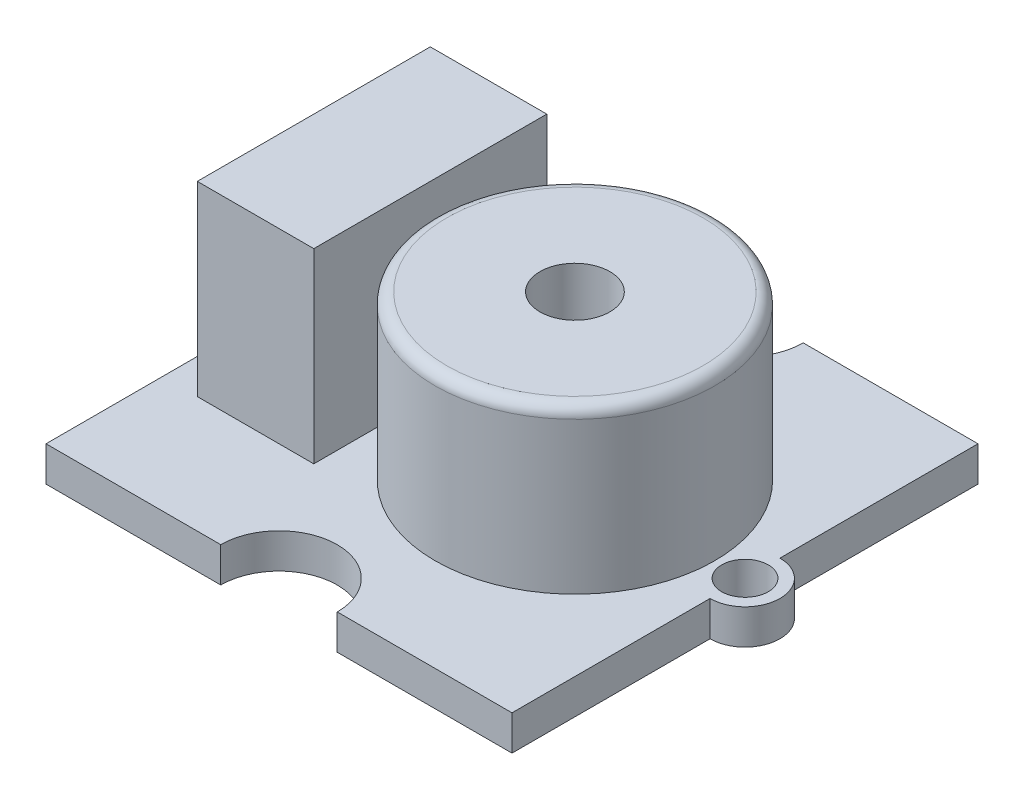
ISO-10303-21;
HEADER;
FILE_DESCRIPTION(('STEP AP214'),'2;1');
FILE_NAME('part.step','',(''),(''),'','','');
FILE_SCHEMA(('AUTOMOTIVE_DESIGN { 1 0 10303 214 1 1 1 1 }'));
ENDSEC;
DATA;
#1=APPLICATION_CONTEXT('core data for automotive mechanical design processes');
#2=APPLICATION_PROTOCOL_DEFINITION('international standard','automotive_design',2000,#1);
#3=PRODUCT_CONTEXT('',#1,'mechanical');
#4=PRODUCT('Part','Part','',(#3));
#5=PRODUCT_RELATED_PRODUCT_CATEGORY('part','',(#4));
#6=PRODUCT_DEFINITION_FORMATION('','',#4);
#7=PRODUCT_DEFINITION_CONTEXT('part definition',#1,'design');
#8=PRODUCT_DEFINITION('design','',#6,#7);
#9=PRODUCT_DEFINITION_SHAPE('','',#8);
#10=(LENGTH_UNIT() NAMED_UNIT(*) SI_UNIT(.MILLI.,.METRE.));
#11=(NAMED_UNIT(*) PLANE_ANGLE_UNIT() SI_UNIT($,.RADIAN.));
#12=(NAMED_UNIT(*) SI_UNIT($,.STERADIAN.) SOLID_ANGLE_UNIT());
#13=UNCERTAINTY_MEASURE_WITH_UNIT(LENGTH_MEASURE(1.E-05),#10,'distance_accuracy_value','');
#14=(GEOMETRIC_REPRESENTATION_CONTEXT(3) GLOBAL_UNCERTAINTY_ASSIGNED_CONTEXT((#13)) GLOBAL_UNIT_ASSIGNED_CONTEXT((#10,
#11,#12)) REPRESENTATION_CONTEXT('',''));
#15=CARTESIAN_POINT('',(0.,0.,0.));
#16=DIRECTION('',(0.,0.,1.));
#17=DIRECTION('',(1.,0.,0.));
#18=AXIS2_PLACEMENT_3D('',#15,#16,#17);
#19=CARTESIAN_POINT('',(0.,1.5,0.));
#20=DIRECTION('',(0.,1.,0.));
#21=DIRECTION('',(0.,0.,1.));
#22=AXIS2_PLACEMENT_3D('',#19,#20,#21);
#23=PLANE('',#22);
#24=CARTESIAN_POINT('',(2.7,1.5,0.));
#25=DIRECTION('',(0.,1.,0.));
#26=DIRECTION('',(0.,0.,1.));
#27=AXIS2_PLACEMENT_3D('',#24,#25,#26);
#28=CIRCLE('',#27,6.);
#29=CARTESIAN_POINT('',(2.7,1.5,6.));
#30=VERTEX_POINT('',#29);
#31=EDGE_CURVE('E559',#30,#30,#28,.T.);
#32=ORIENTED_EDGE('',*,*,#31,.F.);
#33=EDGE_LOOP('',(#32));
#34=FACE_BOUND('',#33,.T.);
#35=CARTESIAN_POINT('',(0.,1.5,10.));
#36=DIRECTION('',(0.,1.,0.));
#37=DIRECTION('',(0.,0.,1.));
#38=AXIS2_PLACEMENT_3D('',#35,#36,#37);
#39=CIRCLE('',#38,2.5);
#40=CARTESIAN_POINT('',(2.50000000000001,1.5,10.));
#41=VERTEX_POINT('',#40);
#42=CARTESIAN_POINT('',(-2.5,1.5,10.));
#43=VERTEX_POINT('',#42);
#44=EDGE_CURVE('E173',#41,#43,#39,.T.);
#45=ORIENTED_EDGE('',*,*,#44,.F.);
#46=DIRECTION('',(1.,0.,0.));
#47=VECTOR('',#46,1.);
#48=CARTESIAN_POINT('',(-9.99999999999999,1.5,10.));
#49=LINE('',#48,#47);
#50=CARTESIAN_POINT('',(10.,1.5,10.));
#51=VERTEX_POINT('',#50);
#52=EDGE_CURVE('E238',#41,#51,#49,.T.);
#53=ORIENTED_EDGE('',*,*,#52,.T.);
#54=DIRECTION('',(0.,0.,-1.));
#55=VECTOR('',#54,1.);
#56=CARTESIAN_POINT('',(10.,1.5,-10.));
#57=LINE('',#56,#55);
#58=CARTESIAN_POINT('',(10.,1.5,1.5));
#59=VERTEX_POINT('',#58);
#60=EDGE_CURVE('E226',#51,#59,#57,.T.);
#61=ORIENTED_EDGE('',*,*,#60,.T.);
#62=CARTESIAN_POINT('',(10.,1.5,0.));
#63=DIRECTION('',(0.,1.,0.));
#64=DIRECTION('',(0.,0.,1.));
#65=AXIS2_PLACEMENT_3D('',#62,#63,#64);
#66=CIRCLE('',#65,1.5);
#67=CARTESIAN_POINT('',(10.,1.5,-1.5));
#68=VERTEX_POINT('',#67);
#69=EDGE_CURVE('E203',#59,#68,#66,.T.);
#70=ORIENTED_EDGE('',*,*,#69,.T.);
#71=CARTESIAN_POINT('',(10.,1.5,-10.));
#72=VERTEX_POINT('',#71);
#73=EDGE_CURVE('E230',#68,#72,#57,.T.);
#74=ORIENTED_EDGE('',*,*,#73,.T.);
#75=DIRECTION('',(-1.,0.,0.));
#76=VECTOR('',#75,1.);
#77=CARTESIAN_POINT('',(-10.,1.5,-10.));
#78=LINE('',#77,#76);
#79=CARTESIAN_POINT('',(2.5,1.5,-10.));
#80=VERTEX_POINT('',#79);
#81=EDGE_CURVE('E231',#72,#80,#78,.T.);
#82=ORIENTED_EDGE('',*,*,#81,.T.);
#83=CARTESIAN_POINT('',(0.,1.5,-10.));
#84=DIRECTION('',(0.,1.,0.));
#85=DIRECTION('',(0.,0.,1.));
#86=AXIS2_PLACEMENT_3D('',#83,#84,#85);
#87=CIRCLE('',#86,2.5);
#88=CARTESIAN_POINT('',(-2.5,1.5,-10.));
#89=VERTEX_POINT('',#88);
#90=EDGE_CURVE('E185',#89,#80,#87,.T.);
#91=ORIENTED_EDGE('',*,*,#90,.F.);
#92=CARTESIAN_POINT('',(-10.,1.5,-10.));
#93=VERTEX_POINT('',#92);
#94=EDGE_CURVE('E229',#89,#93,#78,.T.);
#95=ORIENTED_EDGE('',*,*,#94,.T.);
#96=DIRECTION('',(0.,0.,1.));
#97=VECTOR('',#96,1.);
#98=CARTESIAN_POINT('',(-10.,1.5,-10.));
#99=LINE('',#98,#97);
#100=CARTESIAN_POINT('',(-10.,1.5,-1.5));
#101=VERTEX_POINT('',#100);
#102=EDGE_CURVE('E235',#93,#101,#99,.T.);
#103=ORIENTED_EDGE('',*,*,#102,.T.);
#104=CARTESIAN_POINT('',(-10.,1.5,0.));
#105=DIRECTION('',(0.,1.,0.));
#106=DIRECTION('',(0.,0.,1.));
#107=AXIS2_PLACEMENT_3D('',#104,#105,#106);
#108=CIRCLE('',#107,1.5);
#109=CARTESIAN_POINT('',(-10.,1.5,1.5));
#110=VERTEX_POINT('',#109);
#111=EDGE_CURVE('E215',#101,#110,#108,.T.);
#112=ORIENTED_EDGE('',*,*,#111,.T.);
#113=CARTESIAN_POINT('',(-9.99999999999999,1.5,10.));
#114=VERTEX_POINT('',#113);
#115=EDGE_CURVE('E234',#110,#114,#99,.T.);
#116=ORIENTED_EDGE('',*,*,#115,.T.);
#117=EDGE_CURVE('E239',#114,#43,#49,.T.);
#118=ORIENTED_EDGE('',*,*,#117,.T.);
#119=EDGE_LOOP('',(#45,#53,#61,#70,#74,#82,#91,#95,#103,#112,#116,#118));
#120=FACE_BOUND('',#119,.T.);
#121=CARTESIAN_POINT('',(10.,1.5,0.));
#122=DIRECTION('',(0.,1.,0.));
#123=DIRECTION('',(0.,0.,1.));
#124=AXIS2_PLACEMENT_3D('',#121,#122,#123);
#125=CIRCLE('',#124,1.);
#126=CARTESIAN_POINT('',(10.,1.5,1.));
#127=VERTEX_POINT('',#126);
#128=EDGE_CURVE('E193',#127,#127,#125,.T.);
#129=ORIENTED_EDGE('',*,*,#128,.F.);
#130=EDGE_LOOP('',(#129));
#131=FACE_BOUND('',#130,.T.);
#132=CARTESIAN_POINT('',(-10.,1.5,0.));
#133=DIRECTION('',(0.,1.,0.));
#134=DIRECTION('',(0.,0.,1.));
#135=AXIS2_PLACEMENT_3D('',#132,#133,#134);
#136=CIRCLE('',#135,1.);
#137=CARTESIAN_POINT('',(-10.,1.5,1.));
#138=VERTEX_POINT('',#137);
#139=EDGE_CURVE('E197',#138,#138,#136,.T.);
#140=ORIENTED_EDGE('',*,*,#139,.F.);
#141=EDGE_LOOP('',(#140));
#142=FACE_BOUND('',#141,.T.);
#143=DIRECTION('',(-1.,0.,0.));
#144=VECTOR('',#143,1.);
#145=CARTESIAN_POINT('',(-8.50677552678238,1.5,-5.));
#146=LINE('',#145,#144);
#147=CARTESIAN_POINT('',(-3.50677552678238,1.5,-5.));
#148=VERTEX_POINT('',#147);
#149=CARTESIAN_POINT('',(-8.50677552678238,1.5,-5.));
#150=VERTEX_POINT('',#149);
#151=EDGE_CURVE('E571',#148,#150,#146,.T.);
#152=ORIENTED_EDGE('',*,*,#151,.F.);
#153=DIRECTION('',(0.,0.,-1.));
#154=VECTOR('',#153,1.);
#155=CARTESIAN_POINT('',(-3.50677552678238,1.5,-5.));
#156=LINE('',#155,#154);
#157=CARTESIAN_POINT('',(-3.50677552678237,1.5,5.));
#158=VERTEX_POINT('',#157);
#159=EDGE_CURVE('E171',#158,#148,#156,.T.);
#160=ORIENTED_EDGE('',*,*,#159,.F.);
#161=DIRECTION('',(1.,0.,0.));
#162=VECTOR('',#161,1.);
#163=CARTESIAN_POINT('',(-8.50677552678237,1.5,5.));
#164=LINE('',#163,#162);
#165=CARTESIAN_POINT('',(-8.50677552678237,1.5,5.));
#166=VERTEX_POINT('',#165);
#167=EDGE_CURVE('E167',#166,#158,#164,.T.);
#168=ORIENTED_EDGE('',*,*,#167,.F.);
#169=DIRECTION('',(0.,0.,1.));
#170=VECTOR('',#169,1.);
#171=CARTESIAN_POINT('',(-8.50677552678238,1.5,-5.));
#172=LINE('',#171,#170);
#173=EDGE_CURVE('E573',#150,#166,#172,.T.);
#174=ORIENTED_EDGE('',*,*,#173,.F.);
#175=EDGE_LOOP('',(#152,#160,#168,#174));
#176=FACE_BOUND('',#175,.T.);
#177=ADVANCED_FACE('F35',(#34,#120,#131,#142,#176),#23,.T.);
#178=CARTESIAN_POINT('',(-9.99999999999999,1.5,10.));
#179=DIRECTION('',(0.,0.,-1.));
#180=DIRECTION('',(-1.,0.,0.));
#181=AXIS2_PLACEMENT_3D('',#178,#179,#180);
#182=PLANE('',#181);
#183=DIRECTION('',(1.,0.,0.));
#184=VECTOR('',#183,1.);
#185=CARTESIAN_POINT('',(-9.99999999999999,0.,10.));
#186=LINE('',#185,#184);
#187=CARTESIAN_POINT('',(-9.99999999999999,0.,10.));
#188=VERTEX_POINT('',#187);
#189=CARTESIAN_POINT('',(-2.5,0.,10.));
#190=VERTEX_POINT('',#189);
#191=EDGE_CURVE('E255',#188,#190,#186,.T.);
#192=ORIENTED_EDGE('',*,*,#191,.T.);
#193=DIRECTION('',(0.,1.,0.));
#194=VECTOR('',#193,1.);
#195=CARTESIAN_POINT('',(-2.5,0.,10.));
#196=LINE('',#195,#194);
#197=EDGE_CURVE('E58',#190,#43,#196,.T.);
#198=ORIENTED_EDGE('',*,*,#197,.T.);
#199=ORIENTED_EDGE('',*,*,#117,.F.);
#200=DIRECTION('',(0.,-1.,0.));
#201=VECTOR('',#200,1.);
#202=CARTESIAN_POINT('',(-9.99999999999999,1.5,10.));
#203=LINE('',#202,#201);
#204=EDGE_CURVE('E260',#114,#188,#203,.T.);
#205=ORIENTED_EDGE('',*,*,#204,.T.);
#206=EDGE_LOOP('',(#192,#198,#199,#205));
#207=FACE_BOUND('',#206,.T.);
#208=ADVANCED_FACE('F291',(#207),#182,.F.);
#209=CARTESIAN_POINT('',(-10.,1.5,-10.));
#210=DIRECTION('',(0.,0.,1.));
#211=DIRECTION('',(1.,0.,0.));
#212=AXIS2_PLACEMENT_3D('',#209,#210,#211);
#213=PLANE('',#212);
#214=DIRECTION('',(-1.,0.,0.));
#215=VECTOR('',#214,1.);
#216=CARTESIAN_POINT('',(-10.,0.,-10.));
#217=LINE('',#216,#215);
#218=CARTESIAN_POINT('',(10.,0.,-10.));
#219=VERTEX_POINT('',#218);
#220=CARTESIAN_POINT('',(2.5,0.,-10.));
#221=VERTEX_POINT('',#220);
#222=EDGE_CURVE('E247',#219,#221,#217,.T.);
#223=ORIENTED_EDGE('',*,*,#222,.T.);
#224=DIRECTION('',(0.,1.,0.));
#225=VECTOR('',#224,1.);
#226=CARTESIAN_POINT('',(2.5,0.,-10.));
#227=LINE('',#226,#225);
#228=EDGE_CURVE('E190',#221,#80,#227,.T.);
#229=ORIENTED_EDGE('',*,*,#228,.T.);
#230=ORIENTED_EDGE('',*,*,#81,.F.);
#231=DIRECTION('',(0.,-1.,0.));
#232=VECTOR('',#231,1.);
#233=CARTESIAN_POINT('',(10.,1.5,-10.));
#234=LINE('',#233,#232);
#235=EDGE_CURVE('E266',#72,#219,#234,.T.);
#236=ORIENTED_EDGE('',*,*,#235,.T.);
#237=EDGE_LOOP('',(#223,#229,#230,#236));
#238=FACE_BOUND('',#237,.T.);
#239=ADVANCED_FACE('F297',(#238),#213,.F.);
#240=CARTESIAN_POINT('',(10.,1.5,-10.));
#241=DIRECTION('',(-1.,0.,0.));
#242=DIRECTION('',(0.,0.,1.));
#243=AXIS2_PLACEMENT_3D('',#240,#241,#242);
#244=PLANE('',#243);
#245=DIRECTION('',(0.,0.,-1.));
#246=VECTOR('',#245,1.);
#247=CARTESIAN_POINT('',(10.,0.,-10.));
#248=LINE('',#247,#246);
#249=CARTESIAN_POINT('',(10.,0.,10.));
#250=VERTEX_POINT('',#249);
#251=CARTESIAN_POINT('',(10.,0.,1.5));
#252=VERTEX_POINT('',#251);
#253=EDGE_CURVE('E243',#250,#252,#248,.T.);
#254=ORIENTED_EDGE('',*,*,#253,.T.);
#255=DIRECTION('',(0.,1.,0.));
#256=VECTOR('',#255,1.);
#257=CARTESIAN_POINT('',(10.,0.,1.5));
#258=LINE('',#257,#256);
#259=EDGE_CURVE('E212',#252,#59,#258,.T.);
#260=ORIENTED_EDGE('',*,*,#259,.T.);
#261=ORIENTED_EDGE('',*,*,#60,.F.);
#262=DIRECTION('',(0.,-1.,0.));
#263=VECTOR('',#262,1.);
#264=CARTESIAN_POINT('',(10.,1.5,10.));
#265=LINE('',#264,#263);
#266=EDGE_CURVE('E242',#51,#250,#265,.T.);
#267=ORIENTED_EDGE('',*,*,#266,.T.);
#268=EDGE_LOOP('',(#254,#260,#261,#267));
#269=FACE_BOUND('',#268,.T.);
#270=ADVANCED_FACE('F324',(#269),#244,.F.);
#271=CARTESIAN_POINT('',(-10.,1.5,-10.));
#272=DIRECTION('',(1.,0.,0.));
#273=DIRECTION('',(0.,0.,-1.));
#274=AXIS2_PLACEMENT_3D('',#271,#272,#273);
#275=PLANE('',#274);
#276=DIRECTION('',(0.,0.,1.));
#277=VECTOR('',#276,1.);
#278=CARTESIAN_POINT('',(-10.,0.,-10.));
#279=LINE('',#278,#277);
#280=CARTESIAN_POINT('',(-10.,0.,-10.));
#281=VERTEX_POINT('',#280);
#282=CARTESIAN_POINT('',(-10.,0.,-1.5));
#283=VERTEX_POINT('',#282);
#284=EDGE_CURVE('E251',#281,#283,#279,.T.);
#285=ORIENTED_EDGE('',*,*,#284,.T.);
#286=DIRECTION('',(0.,1.,0.));
#287=VECTOR('',#286,1.);
#288=CARTESIAN_POINT('',(-10.,0.,-1.5));
#289=LINE('',#288,#287);
#290=EDGE_CURVE('E222',#283,#101,#289,.T.);
#291=ORIENTED_EDGE('',*,*,#290,.T.);
#292=ORIENTED_EDGE('',*,*,#102,.F.);
#293=DIRECTION('',(0.,-1.,0.));
#294=VECTOR('',#293,1.);
#295=CARTESIAN_POINT('',(-10.,1.5,-10.));
#296=LINE('',#295,#294);
#297=EDGE_CURVE('E263',#93,#281,#296,.T.);
#298=ORIENTED_EDGE('',*,*,#297,.T.);
#299=EDGE_LOOP('',(#285,#291,#292,#298));
#300=FACE_BOUND('',#299,.T.);
#301=ADVANCED_FACE('F318',(#300),#275,.F.);
#302=ORIENTED_EDGE('',*,*,#73,.F.);
#303=DIRECTION('',(0.,1.,0.));
#304=VECTOR('',#303,1.);
#305=CARTESIAN_POINT('',(10.,0.,-1.5));
#306=LINE('',#305,#304);
#307=CARTESIAN_POINT('',(10.,0.,-1.5));
#308=VERTEX_POINT('',#307);
#309=EDGE_CURVE('E208',#68,#308,#306,.F.);
#310=ORIENTED_EDGE('',*,*,#309,.T.);
#311=EDGE_CURVE('E225',#308,#219,#248,.T.);
#312=ORIENTED_EDGE('',*,*,#311,.T.);
#313=ORIENTED_EDGE('',*,*,#235,.F.);
#314=EDGE_LOOP('',(#302,#310,#312,#313));
#315=FACE_BOUND('',#314,.T.);
#316=ADVANCED_FACE('F320',(#315),#244,.F.);
#317=ORIENTED_EDGE('',*,*,#94,.F.);
#318=DIRECTION('',(0.,1.,0.));
#319=VECTOR('',#318,1.);
#320=CARTESIAN_POINT('',(-2.5,0.,-10.));
#321=LINE('',#320,#319);
#322=CARTESIAN_POINT('',(-2.5,0.,-10.));
#323=VERTEX_POINT('',#322);
#324=EDGE_CURVE('E187',#89,#323,#321,.F.);
#325=ORIENTED_EDGE('',*,*,#324,.T.);
#326=EDGE_CURVE('E246',#323,#281,#217,.T.);
#327=ORIENTED_EDGE('',*,*,#326,.T.);
#328=ORIENTED_EDGE('',*,*,#297,.F.);
#329=EDGE_LOOP('',(#317,#325,#327,#328));
#330=FACE_BOUND('',#329,.T.);
#331=ADVANCED_FACE('F316',(#330),#213,.F.);
#332=ORIENTED_EDGE('',*,*,#115,.F.);
#333=DIRECTION('',(0.,1.,0.));
#334=VECTOR('',#333,1.);
#335=CARTESIAN_POINT('',(-10.,0.,1.5));
#336=LINE('',#335,#334);
#337=CARTESIAN_POINT('',(-10.,0.,1.5));
#338=VERTEX_POINT('',#337);
#339=EDGE_CURVE('E218',#110,#338,#336,.F.);
#340=ORIENTED_EDGE('',*,*,#339,.T.);
#341=EDGE_CURVE('E250',#338,#188,#279,.T.);
#342=ORIENTED_EDGE('',*,*,#341,.T.);
#343=ORIENTED_EDGE('',*,*,#204,.F.);
#344=EDGE_LOOP('',(#332,#340,#342,#343));
#345=FACE_BOUND('',#344,.T.);
#346=ADVANCED_FACE('F312',(#345),#275,.F.);
#347=ORIENTED_EDGE('',*,*,#52,.F.);
#348=DIRECTION('',(0.,1.,0.));
#349=VECTOR('',#348,1.);
#350=CARTESIAN_POINT('',(2.50000000000001,0.,10.));
#351=LINE('',#350,#349);
#352=CARTESIAN_POINT('',(2.50000000000001,0.,10.));
#353=VERTEX_POINT('',#352);
#354=EDGE_CURVE('E180',#41,#353,#351,.F.);
#355=ORIENTED_EDGE('',*,*,#354,.T.);
#356=EDGE_CURVE('E254',#353,#250,#186,.T.);
#357=ORIENTED_EDGE('',*,*,#356,.T.);
#358=ORIENTED_EDGE('',*,*,#266,.F.);
#359=EDGE_LOOP('',(#347,#355,#357,#358));
#360=FACE_BOUND('',#359,.T.);
#361=ADVANCED_FACE('F300',(#360),#182,.F.);
#362=CARTESIAN_POINT('',(0.,0.,0.));
#363=DIRECTION('',(0.,1.,0.));
#364=DIRECTION('',(0.,0.,1.));
#365=AXIS2_PLACEMENT_3D('',#362,#363,#364);
#366=PLANE('',#365);
#367=CARTESIAN_POINT('',(10.,0.,0.));
#368=DIRECTION('',(0.,1.,0.));
#369=DIRECTION('',(0.,0.,1.));
#370=AXIS2_PLACEMENT_3D('',#367,#368,#369);
#371=CIRCLE('',#370,1.);
#372=CARTESIAN_POINT('',(10.,0.,1.));
#373=VERTEX_POINT('',#372);
#374=EDGE_CURVE('E194',#373,#373,#371,.T.);
#375=ORIENTED_EDGE('',*,*,#374,.T.);
#376=EDGE_LOOP('',(#375));
#377=FACE_BOUND('',#376,.T.);
#378=CARTESIAN_POINT('',(-10.,0.,0.));
#379=DIRECTION('',(0.,1.,0.));
#380=DIRECTION('',(0.,0.,1.));
#381=AXIS2_PLACEMENT_3D('',#378,#379,#380);
#382=CIRCLE('',#381,1.);
#383=CARTESIAN_POINT('',(-10.,0.,1.));
#384=VERTEX_POINT('',#383);
#385=EDGE_CURVE('E200',#384,#384,#382,.T.);
#386=ORIENTED_EDGE('',*,*,#385,.T.);
#387=EDGE_LOOP('',(#386));
#388=FACE_BOUND('',#387,.T.);
#389=ORIENTED_EDGE('',*,*,#356,.F.);
#390=CARTESIAN_POINT('',(0.,0.,10.));
#391=DIRECTION('',(0.,1.,0.));
#392=DIRECTION('',(0.,0.,1.));
#393=AXIS2_PLACEMENT_3D('',#390,#391,#392);
#394=CIRCLE('',#393,2.5);
#395=EDGE_CURVE('E175',#353,#190,#394,.T.);
#396=ORIENTED_EDGE('',*,*,#395,.T.);
#397=ORIENTED_EDGE('',*,*,#191,.F.);
#398=ORIENTED_EDGE('',*,*,#341,.F.);
#399=CARTESIAN_POINT('',(-10.,0.,0.));
#400=DIRECTION('',(0.,1.,0.));
#401=DIRECTION('',(0.,0.,1.));
#402=AXIS2_PLACEMENT_3D('',#399,#400,#401);
#403=CIRCLE('',#402,1.5);
#404=EDGE_CURVE('E216',#283,#338,#403,.T.);
#405=ORIENTED_EDGE('',*,*,#404,.F.);
#406=ORIENTED_EDGE('',*,*,#284,.F.);
#407=ORIENTED_EDGE('',*,*,#326,.F.);
#408=CARTESIAN_POINT('',(0.,0.,-10.));
#409=DIRECTION('',(0.,1.,0.));
#410=DIRECTION('',(0.,0.,1.));
#411=AXIS2_PLACEMENT_3D('',#408,#409,#410);
#412=CIRCLE('',#411,2.5);
#413=EDGE_CURVE('E269',#323,#221,#412,.T.);
#414=ORIENTED_EDGE('',*,*,#413,.T.);
#415=ORIENTED_EDGE('',*,*,#222,.F.);
#416=ORIENTED_EDGE('',*,*,#311,.F.);
#417=CARTESIAN_POINT('',(10.,0.,0.));
#418=DIRECTION('',(0.,1.,0.));
#419=DIRECTION('',(0.,0.,1.));
#420=AXIS2_PLACEMENT_3D('',#417,#418,#419);
#421=CIRCLE('',#420,1.5);
#422=EDGE_CURVE('E206',#252,#308,#421,.T.);
#423=ORIENTED_EDGE('',*,*,#422,.F.);
#424=ORIENTED_EDGE('',*,*,#253,.F.);
#425=EDGE_LOOP('',(#389,#396,#397,#398,#405,#406,#407,#414,#415,#416,#423,#424));
#426=FACE_BOUND('',#425,.T.);
#427=ADVANCED_FACE('F307',(#377,#388,#426),#366,.F.);
#428=CARTESIAN_POINT('',(-10.,0.,0.));
#429=DIRECTION('',(0.,1.,0.));
#430=DIRECTION('',(0.,0.,1.));
#431=AXIS2_PLACEMENT_3D('',#428,#429,#430);
#432=CYLINDRICAL_SURFACE('',#431,1.5);
#433=ORIENTED_EDGE('',*,*,#290,.F.);
#434=ORIENTED_EDGE('',*,*,#404,.T.);
#435=ORIENTED_EDGE('',*,*,#339,.F.);
#436=ORIENTED_EDGE('',*,*,#111,.F.);
#437=EDGE_LOOP('',(#433,#434,#435,#436));
#438=FACE_BOUND('',#437,.T.);
#439=ADVANCED_FACE('F305',(#438),#432,.T.);
#440=CARTESIAN_POINT('',(10.,0.,0.));
#441=DIRECTION('',(0.,1.,0.));
#442=DIRECTION('',(0.,0.,1.));
#443=AXIS2_PLACEMENT_3D('',#440,#441,#442);
#444=CYLINDRICAL_SURFACE('',#443,1.5);
#445=ORIENTED_EDGE('',*,*,#259,.F.);
#446=ORIENTED_EDGE('',*,*,#422,.T.);
#447=ORIENTED_EDGE('',*,*,#309,.F.);
#448=ORIENTED_EDGE('',*,*,#69,.F.);
#449=EDGE_LOOP('',(#445,#446,#447,#448));
#450=FACE_BOUND('',#449,.T.);
#451=ADVANCED_FACE('F346',(#450),#444,.T.);
#452=CARTESIAN_POINT('',(-10.,0.,0.));
#453=DIRECTION('',(0.,1.,0.));
#454=DIRECTION('',(0.,0.,1.));
#455=AXIS2_PLACEMENT_3D('',#452,#453,#454);
#456=CYLINDRICAL_SURFACE('',#455,1.);
#457=ORIENTED_EDGE('',*,*,#385,.F.);
#458=EDGE_LOOP('',(#457));
#459=FACE_BOUND('',#458,.T.);
#460=ORIENTED_EDGE('',*,*,#139,.T.);
#461=EDGE_LOOP('',(#460));
#462=FACE_BOUND('',#461,.T.);
#463=ADVANCED_FACE('F382',(#459,#462),#456,.F.);
#464=CARTESIAN_POINT('',(10.,0.,0.));
#465=DIRECTION('',(0.,1.,0.));
#466=DIRECTION('',(0.,0.,1.));
#467=AXIS2_PLACEMENT_3D('',#464,#465,#466);
#468=CYLINDRICAL_SURFACE('',#467,1.);
#469=ORIENTED_EDGE('',*,*,#374,.F.);
#470=EDGE_LOOP('',(#469));
#471=FACE_BOUND('',#470,.T.);
#472=ORIENTED_EDGE('',*,*,#128,.T.);
#473=EDGE_LOOP('',(#472));
#474=FACE_BOUND('',#473,.T.);
#475=ADVANCED_FACE('F376',(#471,#474),#468,.F.);
#476=CARTESIAN_POINT('',(0.,0.,-10.));
#477=DIRECTION('',(0.,1.,0.));
#478=DIRECTION('',(0.,0.,1.));
#479=AXIS2_PLACEMENT_3D('',#476,#477,#478);
#480=CYLINDRICAL_SURFACE('',#479,2.5);
#481=ORIENTED_EDGE('',*,*,#413,.F.);
#482=ORIENTED_EDGE('',*,*,#324,.F.);
#483=ORIENTED_EDGE('',*,*,#90,.T.);
#484=ORIENTED_EDGE('',*,*,#228,.F.);
#485=EDGE_LOOP('',(#481,#482,#483,#484));
#486=FACE_BOUND('',#485,.T.);
#487=ADVANCED_FACE('F353',(#486),#480,.F.);
#488=CARTESIAN_POINT('',(0.,0.,10.));
#489=DIRECTION('',(0.,1.,0.));
#490=DIRECTION('',(0.,0.,1.));
#491=AXIS2_PLACEMENT_3D('',#488,#489,#490);
#492=CYLINDRICAL_SURFACE('',#491,2.5);
#493=ORIENTED_EDGE('',*,*,#395,.F.);
#494=ORIENTED_EDGE('',*,*,#354,.F.);
#495=ORIENTED_EDGE('',*,*,#44,.T.);
#496=ORIENTED_EDGE('',*,*,#197,.F.);
#497=EDGE_LOOP('',(#493,#494,#495,#496));
#498=FACE_BOUND('',#497,.T.);
#499=ADVANCED_FACE('F368',(#498),#492,.F.);
#500=CARTESIAN_POINT('',(-3.50677552678238,9.5,-5.));
#501=DIRECTION('',(-1.,0.,0.));
#502=DIRECTION('',(0.,0.,1.));
#503=AXIS2_PLACEMENT_3D('',#500,#501,#502);
#504=PLANE('',#503);
#505=ORIENTED_EDGE('',*,*,#159,.T.);
#506=DIRECTION('',(0.,-1.,0.));
#507=VECTOR('',#506,1.);
#508=CARTESIAN_POINT('',(-3.50677552678238,9.5,-5.));
#509=LINE('',#508,#507);
#510=CARTESIAN_POINT('',(-3.50677552678238,9.5,-5.));
#511=VERTEX_POINT('',#510);
#512=EDGE_CURVE('E152',#511,#148,#509,.T.);
#513=ORIENTED_EDGE('',*,*,#512,.F.);
#514=DIRECTION('',(0.,0.,-1.));
#515=VECTOR('',#514,1.);
#516=CARTESIAN_POINT('',(-3.50677552678238,9.5,-5.));
#517=LINE('',#516,#515);
#518=CARTESIAN_POINT('',(-3.50677552678237,9.5,5.));
#519=VERTEX_POINT('',#518);
#520=EDGE_CURVE('E159',#519,#511,#517,.T.);
#521=ORIENTED_EDGE('',*,*,#520,.F.);
#522=DIRECTION('',(0.,-1.,0.));
#523=VECTOR('',#522,1.);
#524=CARTESIAN_POINT('',(-3.50677552678237,9.5,5.));
#525=LINE('',#524,#523);
#526=EDGE_CURVE('E569',#519,#158,#525,.T.);
#527=ORIENTED_EDGE('',*,*,#526,.T.);
#528=EDGE_LOOP('',(#505,#513,#521,#527));
#529=FACE_BOUND('',#528,.T.);
#530=ADVANCED_FACE('F169',(#529),#504,.F.);
#531=CARTESIAN_POINT('',(-8.50677552678238,9.5,-5.));
#532=DIRECTION('',(0.,0.,1.));
#533=DIRECTION('',(1.,0.,0.));
#534=AXIS2_PLACEMENT_3D('',#531,#532,#533);
#535=PLANE('',#534);
#536=ORIENTED_EDGE('',*,*,#151,.T.);
#537=DIRECTION('',(0.,-1.,0.));
#538=VECTOR('',#537,1.);
#539=CARTESIAN_POINT('',(-8.50677552678238,9.5,-5.));
#540=LINE('',#539,#538);
#541=CARTESIAN_POINT('',(-8.50677552678238,9.5,-5.));
#542=VERTEX_POINT('',#541);
#543=EDGE_CURVE('E155',#542,#150,#540,.T.);
#544=ORIENTED_EDGE('',*,*,#543,.F.);
#545=DIRECTION('',(-1.,0.,0.));
#546=VECTOR('',#545,1.);
#547=CARTESIAN_POINT('',(-8.50677552678238,9.5,-5.));
#548=LINE('',#547,#546);
#549=EDGE_CURVE('E148',#511,#542,#548,.T.);
#550=ORIENTED_EDGE('',*,*,#549,.F.);
#551=ORIENTED_EDGE('',*,*,#512,.T.);
#552=EDGE_LOOP('',(#536,#544,#550,#551));
#553=FACE_BOUND('',#552,.T.);
#554=ADVANCED_FACE('F150',(#553),#535,.F.);
#555=CARTESIAN_POINT('',(-8.50677552678238,9.5,-5.));
#556=DIRECTION('',(1.,0.,0.));
#557=DIRECTION('',(0.,0.,-1.));
#558=AXIS2_PLACEMENT_3D('',#555,#556,#557);
#559=PLANE('',#558);
#560=ORIENTED_EDGE('',*,*,#173,.T.);
#561=DIRECTION('',(0.,-1.,0.));
#562=VECTOR('',#561,1.);
#563=CARTESIAN_POINT('',(-8.50677552678237,9.5,5.));
#564=LINE('',#563,#562);
#565=CARTESIAN_POINT('',(-8.50677552678237,9.5,5.));
#566=VERTEX_POINT('',#565);
#567=EDGE_CURVE('E50',#566,#166,#564,.T.);
#568=ORIENTED_EDGE('',*,*,#567,.F.);
#569=DIRECTION('',(0.,0.,1.));
#570=VECTOR('',#569,1.);
#571=CARTESIAN_POINT('',(-8.50677552678238,9.5,-5.));
#572=LINE('',#571,#570);
#573=EDGE_CURVE('E158',#542,#566,#572,.T.);
#574=ORIENTED_EDGE('',*,*,#573,.F.);
#575=ORIENTED_EDGE('',*,*,#543,.T.);
#576=EDGE_LOOP('',(#560,#568,#574,#575));
#577=FACE_BOUND('',#576,.T.);
#578=ADVANCED_FACE('F498',(#577),#559,.F.);
#579=CARTESIAN_POINT('',(-8.50677552678237,9.5,5.));
#580=DIRECTION('',(0.,0.,-1.));
#581=DIRECTION('',(-1.,0.,0.));
#582=AXIS2_PLACEMENT_3D('',#579,#580,#581);
#583=PLANE('',#582);
#584=ORIENTED_EDGE('',*,*,#167,.T.);
#585=ORIENTED_EDGE('',*,*,#526,.F.);
#586=DIRECTION('',(1.,0.,0.));
#587=VECTOR('',#586,1.);
#588=CARTESIAN_POINT('',(-8.50677552678237,9.5,5.));
#589=LINE('',#588,#587);
#590=EDGE_CURVE('E163',#566,#519,#589,.T.);
#591=ORIENTED_EDGE('',*,*,#590,.F.);
#592=ORIENTED_EDGE('',*,*,#567,.T.);
#593=EDGE_LOOP('',(#584,#585,#591,#592));
#594=FACE_BOUND('',#593,.T.);
#595=ADVANCED_FACE('F505',(#594),#583,.F.);
#596=CARTESIAN_POINT('',(0.,9.5,0.));
#597=DIRECTION('',(0.,1.,0.));
#598=DIRECTION('',(0.,0.,1.));
#599=AXIS2_PLACEMENT_3D('',#596,#597,#598);
#600=PLANE('',#599);
#601=ORIENTED_EDGE('',*,*,#520,.T.);
#602=ORIENTED_EDGE('',*,*,#549,.T.);
#603=ORIENTED_EDGE('',*,*,#573,.T.);
#604=ORIENTED_EDGE('',*,*,#590,.T.);
#605=EDGE_LOOP('',(#601,#602,#603,#604));
#606=FACE_BOUND('',#605,.T.);
#607=ADVANCED_FACE('F162',(#606),#600,.T.);
#608=CARTESIAN_POINT('',(2.7,8.5,0.));
#609=DIRECTION('',(0.,-1.,0.));
#610=DIRECTION('',(0.,0.,-1.));
#611=AXIS2_PLACEMENT_3D('',#608,#609,#610);
#612=CYLINDRICAL_SURFACE('',#611,6.);
#613=CARTESIAN_POINT('',(2.7,8.,0.));
#614=DIRECTION('',(0.,1.,0.));
#615=DIRECTION('',(0.,0.,1.));
#616=AXIS2_PLACEMENT_3D('',#613,#614,#615);
#617=CIRCLE('',#616,6.);
#618=CARTESIAN_POINT('',(2.7,8.,6.));
#619=VERTEX_POINT('',#618);
#620=EDGE_CURVE('E11',#619,#619,#617,.F.);
#621=ORIENTED_EDGE('',*,*,#620,.T.);
#622=EDGE_LOOP('',(#621));
#623=FACE_BOUND('',#622,.T.);
#624=ORIENTED_EDGE('',*,*,#31,.T.);
#625=EDGE_LOOP('',(#624));
#626=FACE_BOUND('',#625,.T.);
#627=ADVANCED_FACE('F286',(#623,#626),#612,.T.);
#628=CARTESIAN_POINT('',(2.7,8.5,0.));
#629=DIRECTION('',(0.,1.,0.));
#630=DIRECTION('',(0.,0.,1.));
#631=AXIS2_PLACEMENT_3D('',#628,#629,#630);
#632=PLANE('',#631);
#633=CARTESIAN_POINT('',(2.7,8.5,0.));
#634=DIRECTION('',(0.,1.,0.));
#635=DIRECTION('',(0.,0.,1.));
#636=AXIS2_PLACEMENT_3D('',#633,#634,#635);
#637=CIRCLE('',#636,1.5);
#638=CARTESIAN_POINT('',(2.7,8.5,1.5));
#639=VERTEX_POINT('',#638);
#640=EDGE_CURVE('E560',#639,#639,#637,.T.);
#641=ORIENTED_EDGE('',*,*,#640,.F.);
#642=EDGE_LOOP('',(#641));
#643=FACE_BOUND('',#642,.T.);
#644=CARTESIAN_POINT('',(2.7,8.5,0.));
#645=DIRECTION('',(0.,1.,0.));
#646=DIRECTION('',(0.,0.,1.));
#647=AXIS2_PLACEMENT_3D('',#644,#645,#646);
#648=CIRCLE('',#647,5.5);
#649=CARTESIAN_POINT('',(2.7,8.5,5.5));
#650=VERTEX_POINT('',#649);
#651=EDGE_CURVE('E43',#650,#650,#648,.T.);
#652=ORIENTED_EDGE('',*,*,#651,.T.);
#653=EDGE_LOOP('',(#652));
#654=FACE_BOUND('',#653,.T.);
#655=ADVANCED_FACE('F274',(#643,#654),#632,.T.);
#656=CARTESIAN_POINT('',(2.7,8.,0.));
#657=DIRECTION('',(0.,1.,0.));
#658=DIRECTION('',(0.,0.,1.));
#659=AXIS2_PLACEMENT_3D('',#656,#657,#658);
#660=TOROIDAL_SURFACE('',#659,5.5,0.5);
#661=ORIENTED_EDGE('',*,*,#620,.F.);
#662=EDGE_LOOP('',(#661));
#663=FACE_BOUND('',#662,.T.);
#664=ORIENTED_EDGE('',*,*,#651,.F.);
#665=EDGE_LOOP('',(#664));
#666=FACE_BOUND('',#665,.T.);
#667=ADVANCED_FACE('F37',(#663,#666),#660,.T.);
#668=CARTESIAN_POINT('',(2.7,5.5,0.));
#669=DIRECTION('',(0.,1.,0.));
#670=DIRECTION('',(0.,0.,1.));
#671=AXIS2_PLACEMENT_3D('',#668,#669,#670);
#672=CYLINDRICAL_SURFACE('',#671,1.5);
#673=CARTESIAN_POINT('',(2.7,5.5,0.));
#674=DIRECTION('',(0.,1.,0.));
#675=DIRECTION('',(0.,0.,1.));
#676=AXIS2_PLACEMENT_3D('',#673,#674,#675);
#677=CIRCLE('',#676,1.5);
#678=CARTESIAN_POINT('',(2.7,5.5,1.5));
#679=VERTEX_POINT('',#678);
#680=EDGE_CURVE('E558',#679,#679,#677,.T.);
#681=ORIENTED_EDGE('',*,*,#680,.F.);
#682=EDGE_LOOP('',(#681));
#683=FACE_BOUND('',#682,.T.);
#684=ORIENTED_EDGE('',*,*,#640,.T.);
#685=EDGE_LOOP('',(#684));
#686=FACE_BOUND('',#685,.T.);
#687=ADVANCED_FACE('F277',(#683,#686),#672,.F.);
#688=CARTESIAN_POINT('',(2.7,5.5,0.));
#689=DIRECTION('',(0.,1.,0.));
#690=DIRECTION('',(0.,0.,1.));
#691=AXIS2_PLACEMENT_3D('',#688,#689,#690);
#692=PLANE('',#691);
#693=ORIENTED_EDGE('',*,*,#680,.T.);
#694=EDGE_LOOP('',(#693));
#695=FACE_BOUND('',#694,.T.);
#696=ADVANCED_FACE('F283',(#695),#692,.T.);
#697=CLOSED_SHELL('',(#177,#208,#239,#270,#301,#316,#331,#346,#361,#427,#439,#451,#463,#475,
#487,#499,#530,#554,#578,#595,#607,#627,#655,#667,#687,#696));
#698=MANIFOLD_SOLID_BREP('B2',#697);
#699=ADVANCED_BREP_SHAPE_REPRESENTATION('',(#18,#698),#14);
#700=SHAPE_DEFINITION_REPRESENTATION(#9,#699);
ENDSEC;
END-ISO-10303-21;
